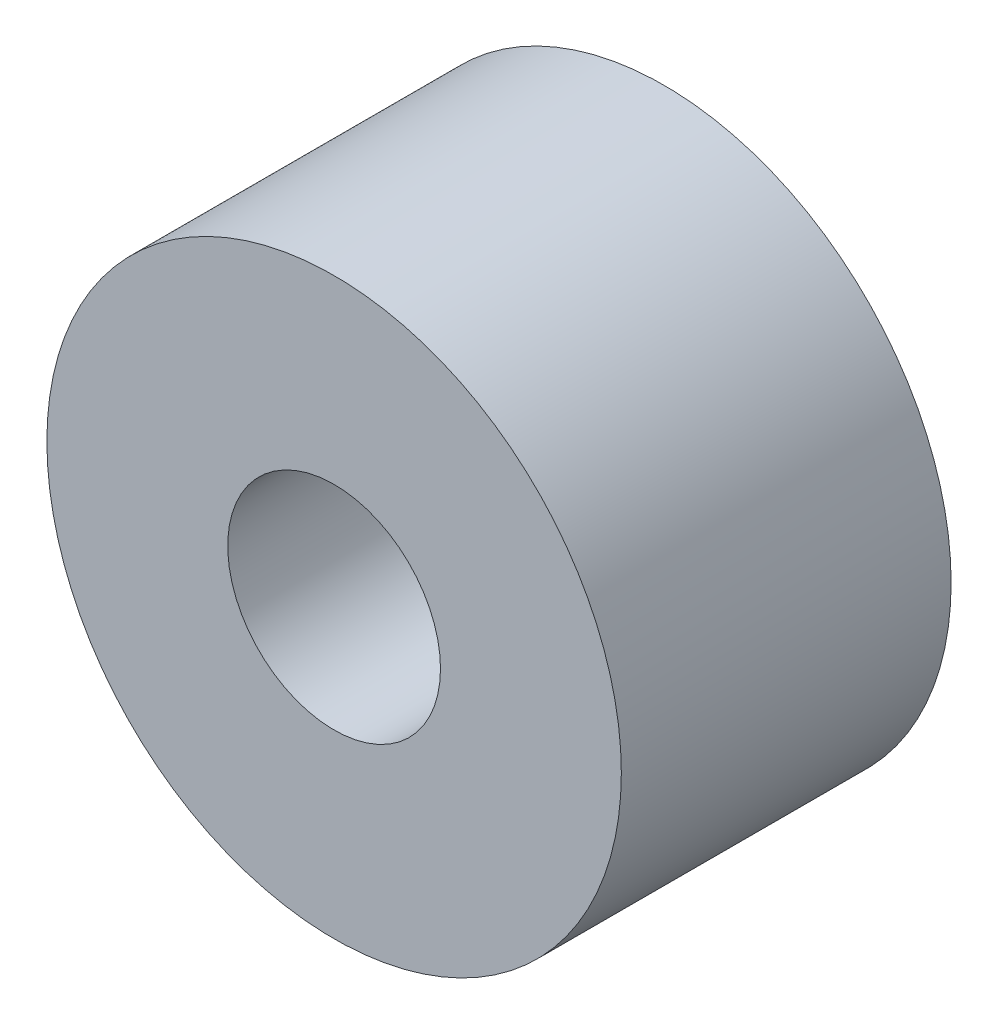
ISO-10303-21;
HEADER;
FILE_DESCRIPTION(('STEP AP214'),'2;1');
FILE_NAME('part.step','',(''),(''),'','','');
FILE_SCHEMA(('AUTOMOTIVE_DESIGN { 1 0 10303 214 1 1 1 1 }'));
ENDSEC;
DATA;
#1=APPLICATION_CONTEXT('core data for automotive mechanical design processes');
#2=APPLICATION_PROTOCOL_DEFINITION('international standard','automotive_design',2000,#1);
#3=PRODUCT_CONTEXT('',#1,'mechanical');
#4=PRODUCT('Part','Part','',(#3));
#5=PRODUCT_RELATED_PRODUCT_CATEGORY('part','',(#4));
#6=PRODUCT_DEFINITION_FORMATION('','',#4);
#7=PRODUCT_DEFINITION_CONTEXT('part definition',#1,'design');
#8=PRODUCT_DEFINITION('design','',#6,#7);
#9=PRODUCT_DEFINITION_SHAPE('','',#8);
#10=(LENGTH_UNIT() NAMED_UNIT(*) SI_UNIT(.MILLI.,.METRE.));
#11=(NAMED_UNIT(*) PLANE_ANGLE_UNIT() SI_UNIT($,.RADIAN.));
#12=(NAMED_UNIT(*) SI_UNIT($,.STERADIAN.) SOLID_ANGLE_UNIT());
#13=UNCERTAINTY_MEASURE_WITH_UNIT(LENGTH_MEASURE(1.E-05),#10,'distance_accuracy_value','');
#14=(GEOMETRIC_REPRESENTATION_CONTEXT(3) GLOBAL_UNCERTAINTY_ASSIGNED_CONTEXT((#13)) GLOBAL_UNIT_ASSIGNED_CONTEXT((#10,
#11,#12)) REPRESENTATION_CONTEXT('',''));
#15=CARTESIAN_POINT('',(0.,0.,0.));
#16=DIRECTION('',(0.,0.,1.));
#17=DIRECTION('',(1.,0.,0.));
#18=AXIS2_PLACEMENT_3D('',#15,#16,#17);
#19=CARTESIAN_POINT('',(0.,0.,9.8425));
#20=DIRECTION('',(0.,0.,1.));
#21=DIRECTION('',(1.,0.,0.));
#22=AXIS2_PLACEMENT_3D('',#19,#20,#21);
#23=PLANE('',#22);
#24=CARTESIAN_POINT('',(0.,0.,9.8425));
#25=DIRECTION('',(0.,0.,1.));
#26=DIRECTION('',(1.,0.,0.));
#27=AXIS2_PLACEMENT_3D('',#24,#25,#26);
#28=CIRCLE('',#27,8.5725);
#29=CARTESIAN_POINT('',(8.5725,0.,9.8425));
#30=VERTEX_POINT('',#29);
#31=EDGE_CURVE('E10',#30,#30,#28,.T.);
#32=ORIENTED_EDGE('',*,*,#31,.T.);
#33=EDGE_LOOP('',(#32));
#34=FACE_BOUND('',#33,.T.);
#35=CARTESIAN_POINT('',(0.,0.,9.8425));
#36=DIRECTION('',(0.,0.,1.));
#37=DIRECTION('',(1.,0.,0.));
#38=AXIS2_PLACEMENT_3D('',#35,#36,#37);
#39=CIRCLE('',#38,3.175);
#40=CARTESIAN_POINT('',(3.175,0.,9.8425));
#41=VERTEX_POINT('',#40);
#42=EDGE_CURVE('E42',#41,#41,#39,.T.);
#43=ORIENTED_EDGE('',*,*,#42,.F.);
#44=EDGE_LOOP('',(#43));
#45=FACE_BOUND('',#44,.T.);
#46=ADVANCED_FACE('F31',(#34,#45),#23,.T.);
#47=CARTESIAN_POINT('',(0.,0.,0.));
#48=DIRECTION('',(0.,0.,1.));
#49=DIRECTION('',(1.,0.,0.));
#50=AXIS2_PLACEMENT_3D('',#47,#48,#49);
#51=PLANE('',#50);
#52=CARTESIAN_POINT('',(0.,0.,0.));
#53=DIRECTION('',(0.,0.,1.));
#54=DIRECTION('',(1.,0.,0.));
#55=AXIS2_PLACEMENT_3D('',#52,#53,#54);
#56=CIRCLE('',#55,8.5725);
#57=CARTESIAN_POINT('',(8.5725,0.,0.));
#58=VERTEX_POINT('',#57);
#59=EDGE_CURVE('E35',#58,#58,#56,.T.);
#60=ORIENTED_EDGE('',*,*,#59,.F.);
#61=EDGE_LOOP('',(#60));
#62=FACE_BOUND('',#61,.T.);
#63=CARTESIAN_POINT('',(0.,0.,0.));
#64=DIRECTION('',(0.,0.,1.));
#65=DIRECTION('',(1.,0.,0.));
#66=AXIS2_PLACEMENT_3D('',#63,#64,#65);
#67=CIRCLE('',#66,3.175);
#68=CARTESIAN_POINT('',(3.175,0.,0.));
#69=VERTEX_POINT('',#68);
#70=EDGE_CURVE('E44',#69,#69,#67,.T.);
#71=ORIENTED_EDGE('',*,*,#70,.T.);
#72=EDGE_LOOP('',(#71));
#73=FACE_BOUND('',#72,.T.);
#74=ADVANCED_FACE('F54',(#62,#73),#51,.F.);
#75=CARTESIAN_POINT('',(0.,0.,9.8425));
#76=DIRECTION('',(0.,0.,-1.));
#77=DIRECTION('',(-1.,0.,0.));
#78=AXIS2_PLACEMENT_3D('',#75,#76,#77);
#79=CYLINDRICAL_SURFACE('',#78,8.5725);
#80=ORIENTED_EDGE('',*,*,#31,.F.);
#81=EDGE_LOOP('',(#80));
#82=FACE_BOUND('',#81,.T.);
#83=ORIENTED_EDGE('',*,*,#59,.T.);
#84=EDGE_LOOP('',(#83));
#85=FACE_BOUND('',#84,.T.);
#86=ADVANCED_FACE('F33',(#82,#85),#79,.T.);
#87=CARTESIAN_POINT('',(0.,0.,9.8425));
#88=DIRECTION('',(0.,0.,-1.));
#89=DIRECTION('',(-1.,0.,0.));
#90=AXIS2_PLACEMENT_3D('',#87,#88,#89);
#91=CYLINDRICAL_SURFACE('',#90,3.175);
#92=ORIENTED_EDGE('',*,*,#42,.T.);
#93=EDGE_LOOP('',(#92));
#94=FACE_BOUND('',#93,.T.);
#95=ORIENTED_EDGE('',*,*,#70,.F.);
#96=EDGE_LOOP('',(#95));
#97=FACE_BOUND('',#96,.T.);
#98=ADVANCED_FACE('F50',(#94,#97),#91,.F.);
#99=CLOSED_SHELL('',(#46,#74,#86,#98));
#100=MANIFOLD_SOLID_BREP('B2',#99);
#101=ADVANCED_BREP_SHAPE_REPRESENTATION('',(#18,#100),#14);
#102=SHAPE_DEFINITION_REPRESENTATION(#9,#101);
ENDSEC;
END-ISO-10303-21;
